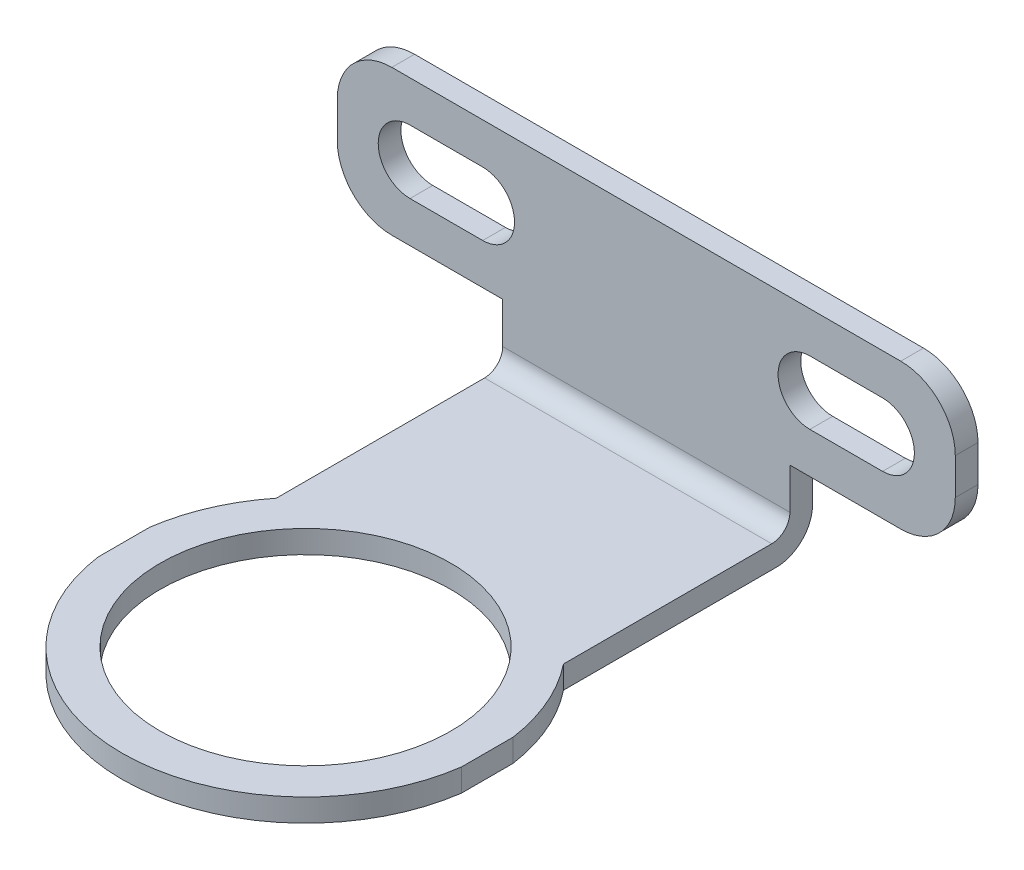
ISO-10303-21;
HEADER;
FILE_DESCRIPTION(('STEP AP214'),'2;1');
FILE_NAME('part.step','',(''),(''),'','','');
FILE_SCHEMA(('AUTOMOTIVE_DESIGN { 1 0 10303 214 1 1 1 1 }'));
ENDSEC;
DATA;
#1=APPLICATION_CONTEXT('core data for automotive mechanical design processes');
#2=APPLICATION_PROTOCOL_DEFINITION('international standard','automotive_design',2000,#1);
#3=PRODUCT_CONTEXT('',#1,'mechanical');
#4=PRODUCT('Part','Part','',(#3));
#5=PRODUCT_RELATED_PRODUCT_CATEGORY('part','',(#4));
#6=PRODUCT_DEFINITION_FORMATION('','',#4);
#7=PRODUCT_DEFINITION_CONTEXT('part definition',#1,'design');
#8=PRODUCT_DEFINITION('design','',#6,#7);
#9=PRODUCT_DEFINITION_SHAPE('','',#8);
#10=(LENGTH_UNIT() NAMED_UNIT(*) SI_UNIT(.MILLI.,.METRE.));
#11=(NAMED_UNIT(*) PLANE_ANGLE_UNIT() SI_UNIT($,.RADIAN.));
#12=(NAMED_UNIT(*) SI_UNIT($,.STERADIAN.) SOLID_ANGLE_UNIT());
#13=UNCERTAINTY_MEASURE_WITH_UNIT(LENGTH_MEASURE(1.E-05),#10,'distance_accuracy_value','');
#14=(GEOMETRIC_REPRESENTATION_CONTEXT(3) GLOBAL_UNCERTAINTY_ASSIGNED_CONTEXT((#13)) GLOBAL_UNIT_ASSIGNED_CONTEXT((#10,
#11,#12)) REPRESENTATION_CONTEXT('',''));
#15=CARTESIAN_POINT('',(0.,0.,0.));
#16=DIRECTION('',(0.,0.,1.));
#17=DIRECTION('',(1.,0.,0.));
#18=AXIS2_PLACEMENT_3D('',#15,#16,#17);
#19=CARTESIAN_POINT('',(-15.8,2.5,0.));
#20=DIRECTION('',(1.,0.,0.));
#21=DIRECTION('',(0.,0.,-1.));
#22=AXIS2_PLACEMENT_3D('',#19,#20,#21);
#23=PLANE('',#22);
#24=DIRECTION('',(0.,-1.,0.));
#25=VECTOR('',#24,1.);
#26=CARTESIAN_POINT('',(-15.8,2.5,0.));
#27=LINE('',#26,#25);
#28=CARTESIAN_POINT('',(-15.8,9.,0.));
#29=VERTEX_POINT('',#28);
#30=CARTESIAN_POINT('',(-15.8,4.,0.));
#31=VERTEX_POINT('',#30);
#32=EDGE_CURVE('E349',#29,#31,#27,.T.);
#33=ORIENTED_EDGE('',*,*,#32,.T.);
#34=CARTESIAN_POINT('',(-15.8,4.,4.));
#35=DIRECTION('',(1.,0.,0.));
#36=DIRECTION('',(0.,0.,-1.));
#37=AXIS2_PLACEMENT_3D('',#34,#35,#36);
#38=CIRCLE('',#37,4.);
#39=CARTESIAN_POINT('',(-15.8,0.,4.));
#40=VERTEX_POINT('',#39);
#41=EDGE_CURVE('E402',#31,#40,#38,.F.);
#42=ORIENTED_EDGE('',*,*,#41,.T.);
#43=DIRECTION('',(0.,0.,1.));
#44=VECTOR('',#43,1.);
#45=CARTESIAN_POINT('',(-15.8,0.,0.));
#46=LINE('',#45,#44);
#47=CARTESIAN_POINT('',(-15.8,0.,27.4142938219582));
#48=VERTEX_POINT('',#47);
#49=EDGE_CURVE('E339',#40,#48,#46,.T.);
#50=ORIENTED_EDGE('',*,*,#49,.T.);
#51=DIRECTION('',(0.,-1.,0.));
#52=VECTOR('',#51,1.);
#53=CARTESIAN_POINT('',(-15.8,2.5,27.4142938219582));
#54=LINE('',#53,#52);
#55=CARTESIAN_POINT('',(-15.8,2.5,27.4142938219582));
#56=VERTEX_POINT('',#55);
#57=EDGE_CURVE('E356',#56,#48,#54,.T.);
#58=ORIENTED_EDGE('',*,*,#57,.F.);
#59=DIRECTION('',(0.,0.,1.));
#60=VECTOR('',#59,1.);
#61=CARTESIAN_POINT('',(-15.8,2.5,0.));
#62=LINE('',#61,#60);
#63=CARTESIAN_POINT('',(-15.8,2.5,4.5));
#64=VERTEX_POINT('',#63);
#65=EDGE_CURVE('E343',#64,#56,#62,.T.);
#66=ORIENTED_EDGE('',*,*,#65,.F.);
#67=CARTESIAN_POINT('',(-15.8,4.5,4.5));
#68=DIRECTION('',(1.,0.,0.));
#69=DIRECTION('',(0.,0.,-1.));
#70=AXIS2_PLACEMENT_3D('',#67,#68,#69);
#71=CIRCLE('',#70,2.);
#72=CARTESIAN_POINT('',(-15.8,4.50000000000001,2.5));
#73=VERTEX_POINT('',#72);
#74=EDGE_CURVE('E397',#64,#73,#71,.T.);
#75=ORIENTED_EDGE('',*,*,#74,.T.);
#76=DIRECTION('',(0.,-1.,0.));
#77=VECTOR('',#76,1.);
#78=CARTESIAN_POINT('',(-15.8,25.,2.5));
#79=LINE('',#78,#77);
#80=CARTESIAN_POINT('',(-15.8,9.,2.5));
#81=VERTEX_POINT('',#80);
#82=EDGE_CURVE('E320',#81,#73,#79,.T.);
#83=ORIENTED_EDGE('',*,*,#82,.F.);
#84=DIRECTION('',(0.,0.,1.));
#85=VECTOR('',#84,1.);
#86=CARTESIAN_POINT('',(-15.8,9.,2.5));
#87=LINE('',#86,#85);
#88=EDGE_CURVE('E280',#29,#81,#87,.T.);
#89=ORIENTED_EDGE('',*,*,#88,.F.);
#90=EDGE_LOOP('',(#33,#42,#50,#58,#66,#75,#83,#89));
#91=FACE_BOUND('',#90,.T.);
#92=ADVANCED_FACE('F34',(#91),#23,.F.);
#93=CARTESIAN_POINT('',(15.8,2.5,27.4142938219582));
#94=DIRECTION('',(-1.,0.,0.));
#95=DIRECTION('',(0.,0.,1.));
#96=AXIS2_PLACEMENT_3D('',#93,#94,#95);
#97=PLANE('',#96);
#98=DIRECTION('',(0.,0.,-1.));
#99=VECTOR('',#98,1.);
#100=CARTESIAN_POINT('',(15.8,0.,27.4142938219582));
#101=LINE('',#100,#99);
#102=CARTESIAN_POINT('',(15.8,0.,27.4142938219583));
#103=VERTEX_POINT('',#102);
#104=CARTESIAN_POINT('',(15.8,0.,4.));
#105=VERTEX_POINT('',#104);
#106=EDGE_CURVE('E328',#103,#105,#101,.T.);
#107=ORIENTED_EDGE('',*,*,#106,.T.);
#108=CARTESIAN_POINT('',(15.8,4.,4.));
#109=DIRECTION('',(-1.,0.,0.));
#110=DIRECTION('',(0.,0.,1.));
#111=AXIS2_PLACEMENT_3D('',#108,#109,#110);
#112=CIRCLE('',#111,4.);
#113=CARTESIAN_POINT('',(15.8,4.,0.));
#114=VERTEX_POINT('',#113);
#115=EDGE_CURVE('E406',#105,#114,#112,.F.);
#116=ORIENTED_EDGE('',*,*,#115,.T.);
#117=DIRECTION('',(0.,-1.,0.));
#118=VECTOR('',#117,1.);
#119=CARTESIAN_POINT('',(15.8,2.5,0.));
#120=LINE('',#119,#118);
#121=CARTESIAN_POINT('',(15.8,9.,0.));
#122=VERTEX_POINT('',#121);
#123=EDGE_CURVE('E336',#122,#114,#120,.T.);
#124=ORIENTED_EDGE('',*,*,#123,.F.);
#125=DIRECTION('',(0.,0.,-1.));
#126=VECTOR('',#125,1.);
#127=CARTESIAN_POINT('',(15.8,9.,0.));
#128=LINE('',#127,#126);
#129=CARTESIAN_POINT('',(15.8,9.,2.5));
#130=VERTEX_POINT('',#129);
#131=EDGE_CURVE('E299',#130,#122,#128,.T.);
#132=ORIENTED_EDGE('',*,*,#131,.F.);
#133=DIRECTION('',(0.,-1.,0.));
#134=VECTOR('',#133,1.);
#135=CARTESIAN_POINT('',(15.8,25.,2.5));
#136=LINE('',#135,#134);
#137=CARTESIAN_POINT('',(15.8,4.50000000000001,2.5));
#138=VERTEX_POINT('',#137);
#139=EDGE_CURVE('E317',#130,#138,#136,.T.);
#140=ORIENTED_EDGE('',*,*,#139,.T.);
#141=CARTESIAN_POINT('',(15.8,4.5,4.5));
#142=DIRECTION('',(-1.,0.,0.));
#143=DIRECTION('',(0.,0.,1.));
#144=AXIS2_PLACEMENT_3D('',#141,#142,#143);
#145=CIRCLE('',#144,2.);
#146=CARTESIAN_POINT('',(15.8,2.5,4.5));
#147=VERTEX_POINT('',#146);
#148=EDGE_CURVE('E395',#138,#147,#145,.T.);
#149=ORIENTED_EDGE('',*,*,#148,.T.);
#150=DIRECTION('',(0.,0.,-1.));
#151=VECTOR('',#150,1.);
#152=CARTESIAN_POINT('',(15.8,2.5,27.4142938219582));
#153=LINE('',#152,#151);
#154=CARTESIAN_POINT('',(15.8,2.5,27.4142938219583));
#155=VERTEX_POINT('',#154);
#156=EDGE_CURVE('E327',#155,#147,#153,.T.);
#157=ORIENTED_EDGE('',*,*,#156,.F.);
#158=DIRECTION('',(0.,-1.,0.));
#159=VECTOR('',#158,1.);
#160=CARTESIAN_POINT('',(15.8,2.5,27.4142938219583));
#161=LINE('',#160,#159);
#162=EDGE_CURVE('E340',#155,#103,#161,.T.);
#163=ORIENTED_EDGE('',*,*,#162,.T.);
#164=EDGE_LOOP('',(#107,#116,#124,#132,#140,#149,#157,#163));
#165=FACE_BOUND('',#164,.T.);
#166=ADVANCED_FACE('F483',(#165),#97,.F.);
#167=CARTESIAN_POINT('',(0.,0.,40.));
#168=DIRECTION('',(0.,1.,0.));
#169=DIRECTION('',(0.,0.,1.));
#170=AXIS2_PLACEMENT_3D('',#167,#168,#169);
#171=CYLINDRICAL_SURFACE('',#170,20.2);
#172=CARTESIAN_POINT('',(0.,2.5,40.));
#173=DIRECTION('',(0.,1.,0.));
#174=DIRECTION('',(0.,0.,1.));
#175=AXIS2_PLACEMENT_3D('',#172,#173,#174);
#176=CIRCLE('',#175,20.2);
#177=CARTESIAN_POINT('',(-20.,2.5,42.8354893757515));
#178=VERTEX_POINT('',#177);
#179=CARTESIAN_POINT('',(20.,2.5,42.8354893757516));
#180=VERTEX_POINT('',#179);
#181=EDGE_CURVE('E355',#178,#180,#176,.T.);
#182=ORIENTED_EDGE('',*,*,#181,.F.);
#183=DIRECTION('',(0.,1.,0.));
#184=VECTOR('',#183,1.);
#185=CARTESIAN_POINT('',(-20.,0.,42.8354893757515));
#186=LINE('',#185,#184);
#187=CARTESIAN_POINT('',(-20.,0.,42.8354893757515));
#188=VERTEX_POINT('',#187);
#189=EDGE_CURVE('E377',#188,#178,#186,.T.);
#190=ORIENTED_EDGE('',*,*,#189,.F.);
#191=CARTESIAN_POINT('',(0.,0.,40.));
#192=DIRECTION('',(0.,1.,0.));
#193=DIRECTION('',(0.,0.,1.));
#194=AXIS2_PLACEMENT_3D('',#191,#192,#193);
#195=CIRCLE('',#194,20.2);
#196=CARTESIAN_POINT('',(20.,0.,42.8354893757516));
#197=VERTEX_POINT('',#196);
#198=EDGE_CURVE('E361',#188,#197,#195,.T.);
#199=ORIENTED_EDGE('',*,*,#198,.T.);
#200=DIRECTION('',(0.,1.,0.));
#201=VECTOR('',#200,1.);
#202=CARTESIAN_POINT('',(20.,0.,42.8354893757516));
#203=LINE('',#202,#201);
#204=EDGE_CURVE('E370',#197,#180,#203,.T.);
#205=ORIENTED_EDGE('',*,*,#204,.T.);
#206=EDGE_LOOP('',(#182,#190,#199,#205));
#207=FACE_BOUND('',#206,.T.);
#208=ADVANCED_FACE('F504',(#207),#171,.T.);
#209=CARTESIAN_POINT('',(-20.,0.,0.));
#210=DIRECTION('',(-1.,0.,0.));
#211=DIRECTION('',(0.,0.,1.));
#212=AXIS2_PLACEMENT_3D('',#209,#210,#211);
#213=PLANE('',#212);
#214=DIRECTION('',(0.,-1.,0.));
#215=VECTOR('',#214,1.);
#216=CARTESIAN_POINT('',(-20.,2.5,37.1645106242483));
#217=LINE('',#216,#215);
#218=CARTESIAN_POINT('',(-20.,2.5,37.1645106242483));
#219=VERTEX_POINT('',#218);
#220=CARTESIAN_POINT('',(-20.,0.,37.1645106242483));
#221=VERTEX_POINT('',#220);
#222=EDGE_CURVE('E352',#219,#221,#217,.T.);
#223=ORIENTED_EDGE('',*,*,#222,.T.);
#224=DIRECTION('',(0.,0.,1.));
#225=VECTOR('',#224,1.);
#226=CARTESIAN_POINT('',(-20.,0.,0.));
#227=LINE('',#226,#225);
#228=EDGE_CURVE('E368',#221,#188,#227,.T.);
#229=ORIENTED_EDGE('',*,*,#228,.T.);
#230=ORIENTED_EDGE('',*,*,#189,.T.);
#231=DIRECTION('',(0.,0.,1.));
#232=VECTOR('',#231,1.);
#233=CARTESIAN_POINT('',(-20.,2.5,0.));
#234=LINE('',#233,#232);
#235=EDGE_CURVE('E365',#219,#178,#234,.T.);
#236=ORIENTED_EDGE('',*,*,#235,.F.);
#237=EDGE_LOOP('',(#223,#229,#230,#236));
#238=FACE_BOUND('',#237,.T.);
#239=ADVANCED_FACE('F507',(#238),#213,.T.);
#240=CARTESIAN_POINT('',(20.,0.,0.));
#241=DIRECTION('',(0.,0.,-1.));
#242=DIRECTION('',(-1.,0.,0.));
#243=AXIS2_PLACEMENT_3D('',#240,#241,#242);
#244=PLANE('',#243);
#245=CARTESIAN_POINT('',(-26.,17.,0.));
#246=DIRECTION('',(0.,0.,-1.));
#247=DIRECTION('',(-1.,0.,0.));
#248=AXIS2_PLACEMENT_3D('',#245,#246,#247);
#249=CIRCLE('',#248,3.5);
#250=CARTESIAN_POINT('',(-26.,13.5,0.));
#251=VERTEX_POINT('',#250);
#252=CARTESIAN_POINT('',(-26.,20.5,0.));
#253=VERTEX_POINT('',#252);
#254=EDGE_CURVE('E240',#251,#253,#249,.T.);
#255=ORIENTED_EDGE('',*,*,#254,.F.);
#256=DIRECTION('',(-1.,0.,0.));
#257=VECTOR('',#256,1.);
#258=CARTESIAN_POINT('',(-18.,13.5,0.));
#259=LINE('',#258,#257);
#260=CARTESIAN_POINT('',(-18.,13.5,0.));
#261=VERTEX_POINT('',#260);
#262=EDGE_CURVE('E245',#261,#251,#259,.T.);
#263=ORIENTED_EDGE('',*,*,#262,.F.);
#264=CARTESIAN_POINT('',(-18.,17.,0.));
#265=DIRECTION('',(0.,0.,-1.));
#266=DIRECTION('',(-1.,0.,0.));
#267=AXIS2_PLACEMENT_3D('',#264,#265,#266);
#268=CIRCLE('',#267,3.5);
#269=CARTESIAN_POINT('',(-18.,20.5,0.));
#270=VERTEX_POINT('',#269);
#271=EDGE_CURVE('E224',#270,#261,#268,.T.);
#272=ORIENTED_EDGE('',*,*,#271,.F.);
#273=DIRECTION('',(1.,0.,0.));
#274=VECTOR('',#273,1.);
#275=CARTESIAN_POINT('',(-26.,20.5,0.));
#276=LINE('',#275,#274);
#277=EDGE_CURVE('E235',#253,#270,#276,.T.);
#278=ORIENTED_EDGE('',*,*,#277,.F.);
#279=EDGE_LOOP('',(#255,#263,#272,#278));
#280=FACE_BOUND('',#279,.T.);
#281=CARTESIAN_POINT('',(26.,17.,0.));
#282=DIRECTION('',(0.,0.,1.));
#283=DIRECTION('',(1.,0.,0.));
#284=AXIS2_PLACEMENT_3D('',#281,#282,#283);
#285=CIRCLE('',#284,3.5);
#286=CARTESIAN_POINT('',(26.,13.5,0.));
#287=VERTEX_POINT('',#286);
#288=CARTESIAN_POINT('',(26.,20.5,0.));
#289=VERTEX_POINT('',#288);
#290=EDGE_CURVE('E255',#287,#289,#285,.T.);
#291=ORIENTED_EDGE('',*,*,#290,.T.);
#292=DIRECTION('',(-1.,0.,0.));
#293=VECTOR('',#292,1.);
#294=CARTESIAN_POINT('',(26.,20.5,0.));
#295=LINE('',#294,#293);
#296=CARTESIAN_POINT('',(18.,20.5,0.));
#297=VERTEX_POINT('',#296);
#298=EDGE_CURVE('E258',#289,#297,#295,.T.);
#299=ORIENTED_EDGE('',*,*,#298,.T.);
#300=CARTESIAN_POINT('',(18.,17.,0.));
#301=DIRECTION('',(0.,0.,1.));
#302=DIRECTION('',(1.,0.,0.));
#303=AXIS2_PLACEMENT_3D('',#300,#301,#302);
#304=CIRCLE('',#303,3.5);
#305=CARTESIAN_POINT('',(18.,13.5,0.));
#306=VERTEX_POINT('',#305);
#307=EDGE_CURVE('E262',#297,#306,#304,.T.);
#308=ORIENTED_EDGE('',*,*,#307,.T.);
#309=DIRECTION('',(1.,0.,0.));
#310=VECTOR('',#309,1.);
#311=CARTESIAN_POINT('',(18.,13.5,0.));
#312=LINE('',#311,#310);
#313=EDGE_CURVE('E265',#306,#287,#312,.T.);
#314=ORIENTED_EDGE('',*,*,#313,.T.);
#315=EDGE_LOOP('',(#291,#299,#308,#314));
#316=FACE_BOUND('',#315,.T.);
#317=DIRECTION('',(0.,-1.,0.));
#318=VECTOR('',#317,1.);
#319=CARTESIAN_POINT('',(-34.,9.,0.));
#320=LINE('',#319,#318);
#321=CARTESIAN_POINT('',(-34.,19.,0.));
#322=VERTEX_POINT('',#321);
#323=CARTESIAN_POINT('',(-34.,15.,0.));
#324=VERTEX_POINT('',#323);
#325=EDGE_CURVE('E290',#322,#324,#320,.T.);
#326=ORIENTED_EDGE('',*,*,#325,.F.);
#327=CARTESIAN_POINT('',(-28.,19.,0.));
#328=DIRECTION('',(0.,0.,-1.));
#329=DIRECTION('',(-1.,0.,0.));
#330=AXIS2_PLACEMENT_3D('',#327,#328,#329);
#331=CIRCLE('',#330,6.);
#332=CARTESIAN_POINT('',(-28.,25.,0.));
#333=VERTEX_POINT('',#332);
#334=EDGE_CURVE('E420',#322,#333,#331,.T.);
#335=ORIENTED_EDGE('',*,*,#334,.T.);
#336=DIRECTION('',(-1.,0.,0.));
#337=VECTOR('',#336,1.);
#338=CARTESIAN_POINT('',(-15.8,25.,0.));
#339=LINE('',#338,#337);
#340=CARTESIAN_POINT('',(28.,25.,0.));
#341=VERTEX_POINT('',#340);
#342=EDGE_CURVE('E311',#341,#333,#339,.T.);
#343=ORIENTED_EDGE('',*,*,#342,.F.);
#344=CARTESIAN_POINT('',(28.,19.,0.));
#345=DIRECTION('',(0.,0.,-1.));
#346=DIRECTION('',(-1.,0.,0.));
#347=AXIS2_PLACEMENT_3D('',#344,#345,#346);
#348=CIRCLE('',#347,6.);
#349=CARTESIAN_POINT('',(34.,19.,0.));
#350=VERTEX_POINT('',#349);
#351=EDGE_CURVE('E414',#341,#350,#348,.T.);
#352=ORIENTED_EDGE('',*,*,#351,.T.);
#353=DIRECTION('',(0.,1.,0.));
#354=VECTOR('',#353,1.);
#355=CARTESIAN_POINT('',(34.,25.,0.));
#356=LINE('',#355,#354);
#357=CARTESIAN_POINT('',(34.,15.,0.));
#358=VERTEX_POINT('',#357);
#359=EDGE_CURVE('E302',#358,#350,#356,.T.);
#360=ORIENTED_EDGE('',*,*,#359,.F.);
#361=CARTESIAN_POINT('',(28.,15.,0.));
#362=DIRECTION('',(0.,0.,-1.));
#363=DIRECTION('',(-1.,0.,0.));
#364=AXIS2_PLACEMENT_3D('',#361,#362,#363);
#365=CIRCLE('',#364,6.);
#366=CARTESIAN_POINT('',(28.,9.,0.));
#367=VERTEX_POINT('',#366);
#368=EDGE_CURVE('E416',#358,#367,#365,.T.);
#369=ORIENTED_EDGE('',*,*,#368,.T.);
#370=DIRECTION('',(-1.,0.,0.));
#371=VECTOR('',#370,1.);
#372=CARTESIAN_POINT('',(34.,9.,0.));
#373=LINE('',#372,#371);
#374=EDGE_CURVE('E305',#367,#122,#373,.T.);
#375=ORIENTED_EDGE('',*,*,#374,.T.);
#376=ORIENTED_EDGE('',*,*,#123,.T.);
#377=DIRECTION('',(-1.,0.,0.));
#378=VECTOR('',#377,1.);
#379=CARTESIAN_POINT('',(-15.8,4.,0.));
#380=LINE('',#379,#378);
#381=EDGE_CURVE('E399',#114,#31,#380,.T.);
#382=ORIENTED_EDGE('',*,*,#381,.T.);
#383=ORIENTED_EDGE('',*,*,#32,.F.);
#384=DIRECTION('',(1.,0.,0.));
#385=VECTOR('',#384,1.);
#386=CARTESIAN_POINT('',(-34.,9.,0.));
#387=LINE('',#386,#385);
#388=CARTESIAN_POINT('',(-28.,9.,0.));
#389=VERTEX_POINT('',#388);
#390=EDGE_CURVE('E293',#389,#29,#387,.T.);
#391=ORIENTED_EDGE('',*,*,#390,.F.);
#392=CARTESIAN_POINT('',(-28.,15.,0.));
#393=DIRECTION('',(0.,0.,-1.));
#394=DIRECTION('',(-1.,0.,0.));
#395=AXIS2_PLACEMENT_3D('',#392,#393,#394);
#396=CIRCLE('',#395,6.);
#397=EDGE_CURVE('E418',#389,#324,#396,.T.);
#398=ORIENTED_EDGE('',*,*,#397,.T.);
#399=EDGE_LOOP('',(#326,#335,#343,#352,#360,#369,#375,#376,#382,#383,#391,#398));
#400=FACE_BOUND('',#399,.T.);
#401=ADVANCED_FACE('F242',(#280,#316,#400),#244,.T.);
#402=CARTESIAN_POINT('',(20.,0.,42.8354893757516));
#403=DIRECTION('',(1.,0.,0.));
#404=DIRECTION('',(0.,0.,-1.));
#405=AXIS2_PLACEMENT_3D('',#402,#403,#404);
#406=PLANE('',#405);
#407=DIRECTION('',(0.,-1.,0.));
#408=VECTOR('',#407,1.);
#409=CARTESIAN_POINT('',(20.,2.5,37.1645106242487));
#410=LINE('',#409,#408);
#411=CARTESIAN_POINT('',(20.,2.5,37.1645106242487));
#412=VERTEX_POINT('',#411);
#413=CARTESIAN_POINT('',(20.,0.,37.1645106242487));
#414=VERTEX_POINT('',#413);
#415=EDGE_CURVE('E331',#412,#414,#410,.T.);
#416=ORIENTED_EDGE('',*,*,#415,.F.);
#417=DIRECTION('',(0.,0.,-1.));
#418=VECTOR('',#417,1.);
#419=CARTESIAN_POINT('',(20.,2.5,42.8354893757516));
#420=LINE('',#419,#418);
#421=EDGE_CURVE('E373',#180,#412,#420,.T.);
#422=ORIENTED_EDGE('',*,*,#421,.F.);
#423=ORIENTED_EDGE('',*,*,#204,.F.);
#424=DIRECTION('',(0.,0.,-1.));
#425=VECTOR('',#424,1.);
#426=CARTESIAN_POINT('',(20.,0.,42.8354893757516));
#427=LINE('',#426,#425);
#428=EDGE_CURVE('E364',#197,#414,#427,.T.);
#429=ORIENTED_EDGE('',*,*,#428,.T.);
#430=EDGE_LOOP('',(#416,#422,#423,#429));
#431=FACE_BOUND('',#430,.T.);
#432=ADVANCED_FACE('F494',(#431),#406,.T.);
#433=CARTESIAN_POINT('',(0.,0.,40.));
#434=DIRECTION('',(0.,1.,0.));
#435=DIRECTION('',(0.,0.,1.));
#436=AXIS2_PLACEMENT_3D('',#433,#434,#435);
#437=PLANE('',#436);
#438=CARTESIAN_POINT('',(0.,0.,40.));
#439=DIRECTION('',(0.,1.,0.));
#440=DIRECTION('',(0.,0.,1.));
#441=AXIS2_PLACEMENT_3D('',#438,#439,#440);
#442=CIRCLE('',#441,16.);
#443=CARTESIAN_POINT('',(0.,0.,56.));
#444=VERTEX_POINT('',#443);
#445=EDGE_CURVE('E824',#444,#444,#442,.T.);
#446=ORIENTED_EDGE('',*,*,#445,.T.);
#447=EDGE_LOOP('',(#446));
#448=FACE_BOUND('',#447,.T.);
#449=ORIENTED_EDGE('',*,*,#49,.F.);
#450=DIRECTION('',(-1.,0.,0.));
#451=VECTOR('',#450,1.);
#452=CARTESIAN_POINT('',(15.8,0.,4.));
#453=LINE('',#452,#451);
#454=EDGE_CURVE('E404',#40,#105,#453,.F.);
#455=ORIENTED_EDGE('',*,*,#454,.T.);
#456=ORIENTED_EDGE('',*,*,#106,.F.);
#457=CARTESIAN_POINT('',(0.,0.,40.));
#458=DIRECTION('',(0.,1.,0.));
#459=DIRECTION('',(0.,0.,1.));
#460=AXIS2_PLACEMENT_3D('',#457,#458,#459);
#461=CIRCLE('',#460,20.2);
#462=EDGE_CURVE('E323',#414,#103,#461,.T.);
#463=ORIENTED_EDGE('',*,*,#462,.F.);
#464=ORIENTED_EDGE('',*,*,#428,.F.);
#465=ORIENTED_EDGE('',*,*,#198,.F.);
#466=ORIENTED_EDGE('',*,*,#228,.F.);
#467=CARTESIAN_POINT('',(0.,0.,40.));
#468=DIRECTION('',(0.,1.,0.));
#469=DIRECTION('',(0.,0.,1.));
#470=AXIS2_PLACEMENT_3D('',#467,#468,#469);
#471=CIRCLE('',#470,20.2);
#472=EDGE_CURVE('E346',#48,#221,#471,.T.);
#473=ORIENTED_EDGE('',*,*,#472,.F.);
#474=EDGE_LOOP('',(#449,#455,#456,#463,#464,#465,#466,#473));
#475=FACE_BOUND('',#474,.T.);
#476=ADVANCED_FACE('F498',(#448,#475),#437,.F.);
#477=CARTESIAN_POINT('',(0.,2.5,40.));
#478=DIRECTION('',(0.,1.,0.));
#479=DIRECTION('',(0.,0.,1.));
#480=AXIS2_PLACEMENT_3D('',#477,#478,#479);
#481=PLANE('',#480);
#482=CARTESIAN_POINT('',(0.,2.5,40.));
#483=DIRECTION('',(0.,1.,0.));
#484=DIRECTION('',(0.,0.,1.));
#485=AXIS2_PLACEMENT_3D('',#482,#483,#484);
#486=CIRCLE('',#485,16.);
#487=CARTESIAN_POINT('',(0.,2.5,56.));
#488=VERTEX_POINT('',#487);
#489=EDGE_CURVE('E827',#488,#488,#486,.T.);
#490=ORIENTED_EDGE('',*,*,#489,.F.);
#491=EDGE_LOOP('',(#490));
#492=FACE_BOUND('',#491,.T.);
#493=ORIENTED_EDGE('',*,*,#156,.T.);
#494=DIRECTION('',(1.,0.,0.));
#495=VECTOR('',#494,1.);
#496=CARTESIAN_POINT('',(0.,2.5,4.5));
#497=LINE('',#496,#495);
#498=EDGE_CURVE('E393',#147,#64,#497,.F.);
#499=ORIENTED_EDGE('',*,*,#498,.T.);
#500=ORIENTED_EDGE('',*,*,#65,.T.);
#501=CARTESIAN_POINT('',(0.,2.5,40.));
#502=DIRECTION('',(0.,1.,0.));
#503=DIRECTION('',(0.,0.,1.));
#504=AXIS2_PLACEMENT_3D('',#501,#502,#503);
#505=CIRCLE('',#504,20.2);
#506=EDGE_CURVE('E345',#56,#219,#505,.T.);
#507=ORIENTED_EDGE('',*,*,#506,.T.);
#508=ORIENTED_EDGE('',*,*,#235,.T.);
#509=ORIENTED_EDGE('',*,*,#181,.T.);
#510=ORIENTED_EDGE('',*,*,#421,.T.);
#511=CARTESIAN_POINT('',(0.,2.5,40.));
#512=DIRECTION('',(0.,1.,0.));
#513=DIRECTION('',(0.,0.,1.));
#514=AXIS2_PLACEMENT_3D('',#511,#512,#513);
#515=CIRCLE('',#514,20.2);
#516=EDGE_CURVE('E324',#412,#155,#515,.T.);
#517=ORIENTED_EDGE('',*,*,#516,.T.);
#518=EDGE_LOOP('',(#493,#499,#500,#507,#508,#509,#510,#517));
#519=FACE_BOUND('',#518,.T.);
#520=ADVANCED_FACE('F487',(#492,#519),#481,.T.);
#521=CARTESIAN_POINT('',(0.,2.5,40.));
#522=DIRECTION('',(0.,-1.,0.));
#523=DIRECTION('',(0.,0.,-1.));
#524=AXIS2_PLACEMENT_3D('',#521,#522,#523);
#525=CYLINDRICAL_SURFACE('',#524,20.2);
#526=ORIENTED_EDGE('',*,*,#472,.T.);
#527=ORIENTED_EDGE('',*,*,#222,.F.);
#528=ORIENTED_EDGE('',*,*,#506,.F.);
#529=ORIENTED_EDGE('',*,*,#57,.T.);
#530=EDGE_LOOP('',(#526,#527,#528,#529));
#531=FACE_BOUND('',#530,.T.);
#532=ADVANCED_FACE('F511',(#531),#525,.T.);
#533=CARTESIAN_POINT('',(0.,2.5,40.));
#534=DIRECTION('',(0.,-1.,0.));
#535=DIRECTION('',(0.,0.,-1.));
#536=AXIS2_PLACEMENT_3D('',#533,#534,#535);
#537=CYLINDRICAL_SURFACE('',#536,20.2);
#538=ORIENTED_EDGE('',*,*,#462,.T.);
#539=ORIENTED_EDGE('',*,*,#162,.F.);
#540=ORIENTED_EDGE('',*,*,#516,.F.);
#541=ORIENTED_EDGE('',*,*,#415,.T.);
#542=EDGE_LOOP('',(#538,#539,#540,#541));
#543=FACE_BOUND('',#542,.T.);
#544=ADVANCED_FACE('F491',(#543),#537,.T.);
#545=CARTESIAN_POINT('',(15.8,25.,2.5));
#546=DIRECTION('',(0.,0.,-1.));
#547=DIRECTION('',(-1.,0.,0.));
#548=AXIS2_PLACEMENT_3D('',#545,#546,#547);
#549=PLANE('',#548);
#550=DIRECTION('',(-1.,0.,0.));
#551=VECTOR('',#550,1.);
#552=CARTESIAN_POINT('',(15.8,13.5,2.5));
#553=LINE('',#552,#551);
#554=CARTESIAN_POINT('',(-18.,13.5,2.5));
#555=VERTEX_POINT('',#554);
#556=CARTESIAN_POINT('',(-26.,13.5,2.5));
#557=VERTEX_POINT('',#556);
#558=EDGE_CURVE('E384',#555,#557,#553,.T.);
#559=ORIENTED_EDGE('',*,*,#558,.T.);
#560=CARTESIAN_POINT('',(-26.,17.,2.5));
#561=DIRECTION('',(0.,0.,-1.));
#562=DIRECTION('',(-1.,0.,0.));
#563=AXIS2_PLACEMENT_3D('',#560,#561,#562);
#564=CIRCLE('',#563,3.5);
#565=CARTESIAN_POINT('',(-26.,20.5,2.5));
#566=VERTEX_POINT('',#565);
#567=EDGE_CURVE('E387',#557,#566,#564,.T.);
#568=ORIENTED_EDGE('',*,*,#567,.T.);
#569=DIRECTION('',(1.,0.,0.));
#570=VECTOR('',#569,1.);
#571=CARTESIAN_POINT('',(15.8,20.5,2.5));
#572=LINE('',#571,#570);
#573=CARTESIAN_POINT('',(-18.,20.5,2.5));
#574=VERTEX_POINT('',#573);
#575=EDGE_CURVE('E380',#566,#574,#572,.T.);
#576=ORIENTED_EDGE('',*,*,#575,.T.);
#577=CARTESIAN_POINT('',(-18.,17.,2.5));
#578=DIRECTION('',(0.,0.,-1.));
#579=DIRECTION('',(-1.,0.,0.));
#580=AXIS2_PLACEMENT_3D('',#577,#578,#579);
#581=CIRCLE('',#580,3.5);
#582=EDGE_CURVE('E227',#574,#555,#581,.T.);
#583=ORIENTED_EDGE('',*,*,#582,.T.);
#584=EDGE_LOOP('',(#559,#568,#576,#583));
#585=FACE_BOUND('',#584,.T.);
#586=DIRECTION('',(-1.,0.,0.));
#587=VECTOR('',#586,1.);
#588=CARTESIAN_POINT('',(26.,20.5,2.5));
#589=LINE('',#588,#587);
#590=CARTESIAN_POINT('',(26.,20.5,2.5));
#591=VERTEX_POINT('',#590);
#592=CARTESIAN_POINT('',(18.,20.5,2.5));
#593=VERTEX_POINT('',#592);
#594=EDGE_CURVE('E270',#591,#593,#589,.T.);
#595=ORIENTED_EDGE('',*,*,#594,.F.);
#596=CARTESIAN_POINT('',(26.,17.,2.5));
#597=DIRECTION('',(0.,0.,1.));
#598=DIRECTION('',(1.,0.,0.));
#599=AXIS2_PLACEMENT_3D('',#596,#597,#598);
#600=CIRCLE('',#599,3.5);
#601=CARTESIAN_POINT('',(26.,13.5,2.5));
#602=VERTEX_POINT('',#601);
#603=EDGE_CURVE('E252',#602,#591,#600,.T.);
#604=ORIENTED_EDGE('',*,*,#603,.F.);
#605=DIRECTION('',(1.,0.,0.));
#606=VECTOR('',#605,1.);
#607=CARTESIAN_POINT('',(18.,13.5,2.5));
#608=LINE('',#607,#606);
#609=CARTESIAN_POINT('',(18.,13.5,2.5));
#610=VERTEX_POINT('',#609);
#611=EDGE_CURVE('E259',#610,#602,#608,.T.);
#612=ORIENTED_EDGE('',*,*,#611,.F.);
#613=CARTESIAN_POINT('',(18.,17.,2.5));
#614=DIRECTION('',(0.,0.,1.));
#615=DIRECTION('',(1.,0.,0.));
#616=AXIS2_PLACEMENT_3D('',#613,#614,#615);
#617=CIRCLE('',#616,3.5);
#618=EDGE_CURVE('E273',#593,#610,#617,.T.);
#619=ORIENTED_EDGE('',*,*,#618,.F.);
#620=EDGE_LOOP('',(#595,#604,#612,#619));
#621=FACE_BOUND('',#620,.T.);
#622=DIRECTION('',(1.,0.,0.));
#623=VECTOR('',#622,1.);
#624=CARTESIAN_POINT('',(15.8,25.,2.5));
#625=LINE('',#624,#623);
#626=CARTESIAN_POINT('',(-28.,25.,2.5));
#627=VERTEX_POINT('',#626);
#628=CARTESIAN_POINT('',(28.,25.,2.5));
#629=VERTEX_POINT('',#628);
#630=EDGE_CURVE('E314',#627,#629,#625,.T.);
#631=ORIENTED_EDGE('',*,*,#630,.F.);
#632=CARTESIAN_POINT('',(-28.,19.,2.5));
#633=DIRECTION('',(0.,0.,-1.));
#634=DIRECTION('',(-1.,0.,0.));
#635=AXIS2_PLACEMENT_3D('',#632,#633,#634);
#636=CIRCLE('',#635,6.);
#637=CARTESIAN_POINT('',(-34.,19.,2.5));
#638=VERTEX_POINT('',#637);
#639=EDGE_CURVE('E430',#627,#638,#636,.F.);
#640=ORIENTED_EDGE('',*,*,#639,.T.);
#641=DIRECTION('',(0.,1.,0.));
#642=VECTOR('',#641,1.);
#643=CARTESIAN_POINT('',(-34.,25.,2.5));
#644=LINE('',#643,#642);
#645=CARTESIAN_POINT('',(-34.,15.,2.5));
#646=VERTEX_POINT('',#645);
#647=EDGE_CURVE('E287',#646,#638,#644,.T.);
#648=ORIENTED_EDGE('',*,*,#647,.F.);
#649=CARTESIAN_POINT('',(-28.,15.,2.5));
#650=DIRECTION('',(0.,0.,-1.));
#651=DIRECTION('',(-1.,0.,0.));
#652=AXIS2_PLACEMENT_3D('',#649,#650,#651);
#653=CIRCLE('',#652,6.);
#654=CARTESIAN_POINT('',(-28.,9.,2.5));
#655=VERTEX_POINT('',#654);
#656=EDGE_CURVE('E49',#646,#655,#653,.F.);
#657=ORIENTED_EDGE('',*,*,#656,.T.);
#658=DIRECTION('',(1.,0.,0.));
#659=VECTOR('',#658,1.);
#660=CARTESIAN_POINT('',(-34.,9.,2.5));
#661=LINE('',#660,#659);
#662=EDGE_CURVE('E297',#655,#81,#661,.T.);
#663=ORIENTED_EDGE('',*,*,#662,.T.);
#664=ORIENTED_EDGE('',*,*,#82,.T.);
#665=DIRECTION('',(1.,0.,0.));
#666=VECTOR('',#665,1.);
#667=CARTESIAN_POINT('',(15.8,4.5,2.5));
#668=LINE('',#667,#666);
#669=EDGE_CURVE('E390',#73,#138,#668,.T.);
#670=ORIENTED_EDGE('',*,*,#669,.T.);
#671=ORIENTED_EDGE('',*,*,#139,.F.);
#672=DIRECTION('',(-1.,0.,0.));
#673=VECTOR('',#672,1.);
#674=CARTESIAN_POINT('',(34.,9.,2.5));
#675=LINE('',#674,#673);
#676=CARTESIAN_POINT('',(28.,9.,2.5));
#677=VERTEX_POINT('',#676);
#678=EDGE_CURVE('E309',#677,#130,#675,.T.);
#679=ORIENTED_EDGE('',*,*,#678,.F.);
#680=CARTESIAN_POINT('',(28.,15.,2.5));
#681=DIRECTION('',(0.,0.,-1.));
#682=DIRECTION('',(-1.,0.,0.));
#683=AXIS2_PLACEMENT_3D('',#680,#681,#682);
#684=CIRCLE('',#683,6.);
#685=CARTESIAN_POINT('',(34.,15.,2.5));
#686=VERTEX_POINT('',#685);
#687=EDGE_CURVE('E56',#677,#686,#684,.F.);
#688=ORIENTED_EDGE('',*,*,#687,.T.);
#689=DIRECTION('',(0.,-1.,0.));
#690=VECTOR('',#689,1.);
#691=CARTESIAN_POINT('',(34.,9.,2.5));
#692=LINE('',#691,#690);
#693=CARTESIAN_POINT('',(34.,19.,2.5));
#694=VERTEX_POINT('',#693);
#695=EDGE_CURVE('E300',#694,#686,#692,.T.);
#696=ORIENTED_EDGE('',*,*,#695,.F.);
#697=CARTESIAN_POINT('',(28.,19.,2.5));
#698=DIRECTION('',(0.,0.,-1.));
#699=DIRECTION('',(-1.,0.,0.));
#700=AXIS2_PLACEMENT_3D('',#697,#698,#699);
#701=CIRCLE('',#700,6.);
#702=EDGE_CURVE('E426',#694,#629,#701,.F.);
#703=ORIENTED_EDGE('',*,*,#702,.T.);
#704=EDGE_LOOP('',(#631,#640,#648,#657,#663,#664,#670,#671,#679,#688,#696,#703));
#705=FACE_BOUND('',#704,.T.);
#706=ADVANCED_FACE('F451',(#585,#621,#705),#549,.F.);
#707=CARTESIAN_POINT('',(0.,25.,0.));
#708=DIRECTION('',(0.,-1.,0.));
#709=DIRECTION('',(0.,0.,-1.));
#710=AXIS2_PLACEMENT_3D('',#707,#708,#709);
#711=PLANE('',#710);
#712=ORIENTED_EDGE('',*,*,#342,.T.);
#713=DIRECTION('',(0.,0.,-1.));
#714=VECTOR('',#713,1.);
#715=CARTESIAN_POINT('',(-28.,25.,0.));
#716=LINE('',#715,#714);
#717=EDGE_CURVE('E424',#333,#627,#716,.F.);
#718=ORIENTED_EDGE('',*,*,#717,.T.);
#719=ORIENTED_EDGE('',*,*,#630,.T.);
#720=DIRECTION('',(0.,0.,1.));
#721=VECTOR('',#720,1.);
#722=CARTESIAN_POINT('',(28.,25.,0.));
#723=LINE('',#722,#721);
#724=EDGE_CURVE('E422',#629,#341,#723,.F.);
#725=ORIENTED_EDGE('',*,*,#724,.T.);
#726=EDGE_LOOP('',(#712,#718,#719,#725));
#727=FACE_BOUND('',#726,.T.);
#728=ADVANCED_FACE('F454',(#727),#711,.F.);
#729=CARTESIAN_POINT('',(34.,9.,0.));
#730=DIRECTION('',(0.,1.,0.));
#731=DIRECTION('',(0.,0.,1.));
#732=AXIS2_PLACEMENT_3D('',#729,#730,#731);
#733=PLANE('',#732);
#734=ORIENTED_EDGE('',*,*,#374,.F.);
#735=DIRECTION('',(0.,0.,-1.));
#736=VECTOR('',#735,1.);
#737=CARTESIAN_POINT('',(28.,9.,0.));
#738=LINE('',#737,#736);
#739=EDGE_CURVE('E11',#367,#677,#738,.F.);
#740=ORIENTED_EDGE('',*,*,#739,.T.);
#741=ORIENTED_EDGE('',*,*,#678,.T.);
#742=ORIENTED_EDGE('',*,*,#131,.T.);
#743=EDGE_LOOP('',(#734,#740,#741,#742));
#744=FACE_BOUND('',#743,.T.);
#745=ADVANCED_FACE('F558',(#744),#733,.F.);
#746=CARTESIAN_POINT('',(34.,0.,0.));
#747=DIRECTION('',(-1.,0.,0.));
#748=DIRECTION('',(0.,0.,1.));
#749=AXIS2_PLACEMENT_3D('',#746,#747,#748);
#750=PLANE('',#749);
#751=ORIENTED_EDGE('',*,*,#695,.T.);
#752=DIRECTION('',(0.,0.,-1.));
#753=VECTOR('',#752,1.);
#754=CARTESIAN_POINT('',(34.,15.,0.));
#755=LINE('',#754,#753);
#756=EDGE_CURVE('E42',#686,#358,#755,.T.);
#757=ORIENTED_EDGE('',*,*,#756,.T.);
#758=ORIENTED_EDGE('',*,*,#359,.T.);
#759=DIRECTION('',(0.,0.,1.));
#760=VECTOR('',#759,1.);
#761=CARTESIAN_POINT('',(34.,19.,0.));
#762=LINE('',#761,#760);
#763=EDGE_CURVE('E434',#350,#694,#762,.T.);
#764=ORIENTED_EDGE('',*,*,#763,.T.);
#765=EDGE_LOOP('',(#751,#757,#758,#764));
#766=FACE_BOUND('',#765,.T.);
#767=ADVANCED_FACE('F440',(#766),#750,.F.);
#768=CARTESIAN_POINT('',(-34.,9.,2.5));
#769=DIRECTION('',(0.,1.,0.));
#770=DIRECTION('',(0.,0.,1.));
#771=AXIS2_PLACEMENT_3D('',#768,#769,#770);
#772=PLANE('',#771);
#773=ORIENTED_EDGE('',*,*,#662,.F.);
#774=DIRECTION('',(0.,0.,1.));
#775=VECTOR('',#774,1.);
#776=CARTESIAN_POINT('',(-28.,9.,2.5));
#777=LINE('',#776,#775);
#778=EDGE_CURVE('E432',#655,#389,#777,.F.);
#779=ORIENTED_EDGE('',*,*,#778,.T.);
#780=ORIENTED_EDGE('',*,*,#390,.T.);
#781=ORIENTED_EDGE('',*,*,#88,.T.);
#782=EDGE_LOOP('',(#773,#779,#780,#781));
#783=FACE_BOUND('',#782,.T.);
#784=ADVANCED_FACE('F468',(#783),#772,.F.);
#785=CARTESIAN_POINT('',(-34.,0.,0.));
#786=DIRECTION('',(1.,0.,0.));
#787=DIRECTION('',(0.,0.,-1.));
#788=AXIS2_PLACEMENT_3D('',#785,#786,#787);
#789=PLANE('',#788);
#790=ORIENTED_EDGE('',*,*,#647,.T.);
#791=DIRECTION('',(0.,0.,-1.));
#792=VECTOR('',#791,1.);
#793=CARTESIAN_POINT('',(-34.,19.,0.));
#794=LINE('',#793,#792);
#795=EDGE_CURVE('E411',#638,#322,#794,.T.);
#796=ORIENTED_EDGE('',*,*,#795,.T.);
#797=ORIENTED_EDGE('',*,*,#325,.T.);
#798=DIRECTION('',(0.,0.,1.));
#799=VECTOR('',#798,1.);
#800=CARTESIAN_POINT('',(-34.,15.,0.));
#801=LINE('',#800,#799);
#802=EDGE_CURVE('E408',#324,#646,#801,.T.);
#803=ORIENTED_EDGE('',*,*,#802,.T.);
#804=EDGE_LOOP('',(#790,#796,#797,#803));
#805=FACE_BOUND('',#804,.T.);
#806=ADVANCED_FACE('F460',(#805),#789,.F.);
#807=CARTESIAN_POINT('',(26.,17.,0.));
#808=DIRECTION('',(0.,0.,1.));
#809=DIRECTION('',(1.,0.,0.));
#810=AXIS2_PLACEMENT_3D('',#807,#808,#809);
#811=CYLINDRICAL_SURFACE('',#810,3.5);
#812=ORIENTED_EDGE('',*,*,#603,.T.);
#813=DIRECTION('',(0.,0.,1.));
#814=VECTOR('',#813,1.);
#815=CARTESIAN_POINT('',(26.,20.5,0.));
#816=LINE('',#815,#814);
#817=EDGE_CURVE('E268',#289,#591,#816,.T.);
#818=ORIENTED_EDGE('',*,*,#817,.F.);
#819=ORIENTED_EDGE('',*,*,#290,.F.);
#820=DIRECTION('',(0.,0.,1.));
#821=VECTOR('',#820,1.);
#822=CARTESIAN_POINT('',(26.,13.5,0.));
#823=LINE('',#822,#821);
#824=EDGE_CURVE('E278',#287,#602,#823,.T.);
#825=ORIENTED_EDGE('',*,*,#824,.T.);
#826=EDGE_LOOP('',(#812,#818,#819,#825));
#827=FACE_BOUND('',#826,.T.);
#828=ADVANCED_FACE('F586',(#827),#811,.F.);
#829=CARTESIAN_POINT('',(18.,13.5,0.));
#830=DIRECTION('',(0.,-1.,0.));
#831=DIRECTION('',(1.,0.,0.));
#832=AXIS2_PLACEMENT_3D('',#829,#830,#831);
#833=PLANE('',#832);
#834=ORIENTED_EDGE('',*,*,#611,.T.);
#835=ORIENTED_EDGE('',*,*,#824,.F.);
#836=ORIENTED_EDGE('',*,*,#313,.F.);
#837=DIRECTION('',(0.,0.,1.));
#838=VECTOR('',#837,1.);
#839=CARTESIAN_POINT('',(18.,13.5,0.));
#840=LINE('',#839,#838);
#841=EDGE_CURVE('E281',#306,#610,#840,.T.);
#842=ORIENTED_EDGE('',*,*,#841,.T.);
#843=EDGE_LOOP('',(#834,#835,#836,#842));
#844=FACE_BOUND('',#843,.T.);
#845=ADVANCED_FACE('F589',(#844),#833,.F.);
#846=CARTESIAN_POINT('',(18.,17.,0.));
#847=DIRECTION('',(0.,0.,1.));
#848=DIRECTION('',(1.,0.,0.));
#849=AXIS2_PLACEMENT_3D('',#846,#847,#848);
#850=CYLINDRICAL_SURFACE('',#849,3.5);
#851=ORIENTED_EDGE('',*,*,#618,.T.);
#852=ORIENTED_EDGE('',*,*,#841,.F.);
#853=ORIENTED_EDGE('',*,*,#307,.F.);
#854=DIRECTION('',(0.,0.,1.));
#855=VECTOR('',#854,1.);
#856=CARTESIAN_POINT('',(18.,20.5,0.));
#857=LINE('',#856,#855);
#858=EDGE_CURVE('E283',#297,#593,#857,.T.);
#859=ORIENTED_EDGE('',*,*,#858,.T.);
#860=EDGE_LOOP('',(#851,#852,#853,#859));
#861=FACE_BOUND('',#860,.T.);
#862=ADVANCED_FACE('F591',(#861),#850,.F.);
#863=CARTESIAN_POINT('',(26.,20.5,0.));
#864=DIRECTION('',(0.,1.,0.));
#865=DIRECTION('',(0.,0.,1.));
#866=AXIS2_PLACEMENT_3D('',#863,#864,#865);
#867=PLANE('',#866);
#868=ORIENTED_EDGE('',*,*,#594,.T.);
#869=ORIENTED_EDGE('',*,*,#858,.F.);
#870=ORIENTED_EDGE('',*,*,#298,.F.);
#871=ORIENTED_EDGE('',*,*,#817,.T.);
#872=EDGE_LOOP('',(#868,#869,#870,#871));
#873=FACE_BOUND('',#872,.T.);
#874=ADVANCED_FACE('F582',(#873),#867,.F.);
#875=CARTESIAN_POINT('',(-26.,17.,60.2));
#876=DIRECTION('',(0.,0.,-1.));
#877=DIRECTION('',(-1.,0.,0.));
#878=AXIS2_PLACEMENT_3D('',#875,#876,#877);
#879=CYLINDRICAL_SURFACE('',#878,3.5);
#880=DIRECTION('',(0.,0.,-1.));
#881=VECTOR('',#880,1.);
#882=CARTESIAN_POINT('',(-26.,13.5,60.2));
#883=LINE('',#882,#881);
#884=EDGE_CURVE('E250',#557,#251,#883,.T.);
#885=ORIENTED_EDGE('',*,*,#884,.T.);
#886=ORIENTED_EDGE('',*,*,#254,.T.);
#887=DIRECTION('',(0.,0.,-1.));
#888=VECTOR('',#887,1.);
#889=CARTESIAN_POINT('',(-26.,20.5,60.2));
#890=LINE('',#889,#888);
#891=EDGE_CURVE('E231',#566,#253,#890,.T.);
#892=ORIENTED_EDGE('',*,*,#891,.F.);
#893=ORIENTED_EDGE('',*,*,#567,.F.);
#894=EDGE_LOOP('',(#885,#886,#892,#893));
#895=FACE_BOUND('',#894,.T.);
#896=ADVANCED_FACE('F598',(#895),#879,.F.);
#897=CARTESIAN_POINT('',(-18.,13.5,60.2));
#898=DIRECTION('',(0.,-1.,0.));
#899=DIRECTION('',(1.,0.,0.));
#900=AXIS2_PLACEMENT_3D('',#897,#898,#899);
#901=PLANE('',#900);
#902=DIRECTION('',(0.,0.,-1.));
#903=VECTOR('',#902,1.);
#904=CARTESIAN_POINT('',(-18.,13.5,60.2));
#905=LINE('',#904,#903);
#906=EDGE_CURVE('E230',#555,#261,#905,.T.);
#907=ORIENTED_EDGE('',*,*,#906,.T.);
#908=ORIENTED_EDGE('',*,*,#262,.T.);
#909=ORIENTED_EDGE('',*,*,#884,.F.);
#910=ORIENTED_EDGE('',*,*,#558,.F.);
#911=EDGE_LOOP('',(#907,#908,#909,#910));
#912=FACE_BOUND('',#911,.T.);
#913=ADVANCED_FACE('F644',(#912),#901,.F.);
#914=CARTESIAN_POINT('',(-18.,17.,60.2));
#915=DIRECTION('',(0.,0.,-1.));
#916=DIRECTION('',(-1.,0.,0.));
#917=AXIS2_PLACEMENT_3D('',#914,#915,#916);
#918=CYLINDRICAL_SURFACE('',#917,3.5);
#919=DIRECTION('',(0.,0.,-1.));
#920=VECTOR('',#919,1.);
#921=CARTESIAN_POINT('',(-18.,20.5,60.2));
#922=LINE('',#921,#920);
#923=EDGE_CURVE('E219',#574,#270,#922,.T.);
#924=ORIENTED_EDGE('',*,*,#923,.T.);
#925=ORIENTED_EDGE('',*,*,#271,.T.);
#926=ORIENTED_EDGE('',*,*,#906,.F.);
#927=ORIENTED_EDGE('',*,*,#582,.F.);
#928=EDGE_LOOP('',(#924,#925,#926,#927));
#929=FACE_BOUND('',#928,.T.);
#930=ADVANCED_FACE('F221',(#929),#918,.F.);
#931=CARTESIAN_POINT('',(-26.,20.5,60.2));
#932=DIRECTION('',(0.,1.,0.));
#933=DIRECTION('',(0.,0.,1.));
#934=AXIS2_PLACEMENT_3D('',#931,#932,#933);
#935=PLANE('',#934);
#936=ORIENTED_EDGE('',*,*,#891,.T.);
#937=ORIENTED_EDGE('',*,*,#277,.T.);
#938=ORIENTED_EDGE('',*,*,#923,.F.);
#939=ORIENTED_EDGE('',*,*,#575,.F.);
#940=EDGE_LOOP('',(#936,#937,#938,#939));
#941=FACE_BOUND('',#940,.T.);
#942=ADVANCED_FACE('F236',(#941),#935,.F.);
#943=CARTESIAN_POINT('',(0.,2.5,40.));
#944=DIRECTION('',(0.,1.,0.));
#945=DIRECTION('',(0.,0.,1.));
#946=AXIS2_PLACEMENT_3D('',#943,#944,#945);
#947=CYLINDRICAL_SURFACE('',#946,16.);
#948=ORIENTED_EDGE('',*,*,#445,.F.);
#949=EDGE_LOOP('',(#948));
#950=FACE_BOUND('',#949,.T.);
#951=ORIENTED_EDGE('',*,*,#489,.T.);
#952=EDGE_LOOP('',(#951));
#953=FACE_BOUND('',#952,.T.);
#954=ADVANCED_FACE('F544',(#950,#953),#947,.F.);
#955=CARTESIAN_POINT('',(15.8,4.5,4.5));
#956=DIRECTION('',(1.,0.,0.));
#957=DIRECTION('',(0.,0.,-1.));
#958=AXIS2_PLACEMENT_3D('',#955,#956,#957);
#959=CYLINDRICAL_SURFACE('',#958,2.);
#960=ORIENTED_EDGE('',*,*,#74,.F.);
#961=ORIENTED_EDGE('',*,*,#498,.F.);
#962=ORIENTED_EDGE('',*,*,#148,.F.);
#963=ORIENTED_EDGE('',*,*,#669,.F.);
#964=EDGE_LOOP('',(#960,#961,#962,#963));
#965=FACE_BOUND('',#964,.T.);
#966=ADVANCED_FACE('F480',(#965),#959,.F.);
#967=CARTESIAN_POINT('',(20.,4.,4.));
#968=DIRECTION('',(1.,0.,0.));
#969=DIRECTION('',(0.,0.,-1.));
#970=AXIS2_PLACEMENT_3D('',#967,#968,#969);
#971=CYLINDRICAL_SURFACE('',#970,4.);
#972=ORIENTED_EDGE('',*,*,#115,.F.);
#973=ORIENTED_EDGE('',*,*,#454,.F.);
#974=ORIENTED_EDGE('',*,*,#41,.F.);
#975=ORIENTED_EDGE('',*,*,#381,.F.);
#976=EDGE_LOOP('',(#972,#973,#974,#975));
#977=FACE_BOUND('',#976,.T.);
#978=ADVANCED_FACE('F543',(#977),#971,.T.);
#979=CARTESIAN_POINT('',(-28.,19.,0.));
#980=DIRECTION('',(0.,0.,-1.));
#981=DIRECTION('',(-1.,0.,0.));
#982=AXIS2_PLACEMENT_3D('',#979,#980,#981);
#983=CYLINDRICAL_SURFACE('',#982,6.);
#984=ORIENTED_EDGE('',*,*,#639,.F.);
#985=ORIENTED_EDGE('',*,*,#717,.F.);
#986=ORIENTED_EDGE('',*,*,#334,.F.);
#987=ORIENTED_EDGE('',*,*,#795,.F.);
#988=EDGE_LOOP('',(#984,#985,#986,#987));
#989=FACE_BOUND('',#988,.T.);
#990=ADVANCED_FACE('F457',(#989),#983,.T.);
#991=CARTESIAN_POINT('',(-28.,15.,0.));
#992=DIRECTION('',(0.,0.,1.));
#993=DIRECTION('',(1.,0.,0.));
#994=AXIS2_PLACEMENT_3D('',#991,#992,#993);
#995=CYLINDRICAL_SURFACE('',#994,6.);
#996=ORIENTED_EDGE('',*,*,#397,.F.);
#997=ORIENTED_EDGE('',*,*,#778,.F.);
#998=ORIENTED_EDGE('',*,*,#656,.F.);
#999=ORIENTED_EDGE('',*,*,#802,.F.);
#1000=EDGE_LOOP('',(#996,#997,#998,#999));
#1001=FACE_BOUND('',#1000,.T.);
#1002=ADVANCED_FACE('F464',(#1001),#995,.T.);
#1003=CARTESIAN_POINT('',(28.,15.,0.));
#1004=DIRECTION('',(0.,0.,-1.));
#1005=DIRECTION('',(-1.,0.,0.));
#1006=AXIS2_PLACEMENT_3D('',#1003,#1004,#1005);
#1007=CYLINDRICAL_SURFACE('',#1006,6.);
#1008=ORIENTED_EDGE('',*,*,#687,.F.);
#1009=ORIENTED_EDGE('',*,*,#739,.F.);
#1010=ORIENTED_EDGE('',*,*,#368,.F.);
#1011=ORIENTED_EDGE('',*,*,#756,.F.);
#1012=EDGE_LOOP('',(#1008,#1009,#1010,#1011));
#1013=FACE_BOUND('',#1012,.T.);
#1014=ADVANCED_FACE('F551',(#1013),#1007,.T.);
#1015=CARTESIAN_POINT('',(28.,19.,0.));
#1016=DIRECTION('',(0.,0.,1.));
#1017=DIRECTION('',(1.,0.,0.));
#1018=AXIS2_PLACEMENT_3D('',#1015,#1016,#1017);
#1019=CYLINDRICAL_SURFACE('',#1018,6.);
#1020=ORIENTED_EDGE('',*,*,#351,.F.);
#1021=ORIENTED_EDGE('',*,*,#724,.F.);
#1022=ORIENTED_EDGE('',*,*,#702,.F.);
#1023=ORIENTED_EDGE('',*,*,#763,.F.);
#1024=EDGE_LOOP('',(#1020,#1021,#1022,#1023));
#1025=FACE_BOUND('',#1024,.T.);
#1026=ADVANCED_FACE('F36',(#1025),#1019,.T.);
#1027=CLOSED_SHELL('',(#92,#166,#208,#239,#401,#432,#476,#520,#532,#544,#706,#728,#745,#767,
#784,#806,#828,#845,#862,#874,#896,#913,#930,#942,#954,#966,#978,#990,#1002,#1014,#1026));
#1028=MANIFOLD_SOLID_BREP('B2',#1027);
#1029=ADVANCED_BREP_SHAPE_REPRESENTATION('',(#18,#1028),#14);
#1030=SHAPE_DEFINITION_REPRESENTATION(#9,#1029);
ENDSEC;
END-ISO-10303-21;
